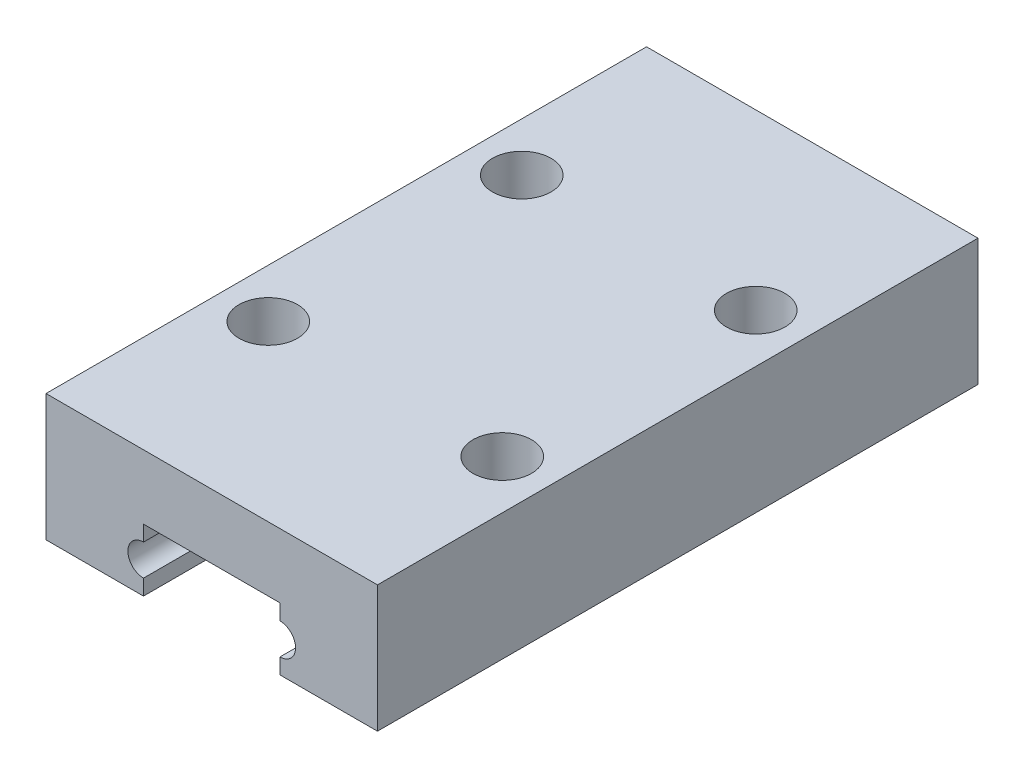
ISO-10303-21;
HEADER;
FILE_DESCRIPTION(('STEP AP214'),'2;1');
FILE_NAME('part.step','',(''),(''),'','','');
FILE_SCHEMA(('AUTOMOTIVE_DESIGN { 1 0 10303 214 1 1 1 1 }'));
ENDSEC;
DATA;
#1=APPLICATION_CONTEXT('core data for automotive mechanical design processes');
#2=APPLICATION_PROTOCOL_DEFINITION('international standard','automotive_design',2000,#1);
#3=PRODUCT_CONTEXT('',#1,'mechanical');
#4=PRODUCT('Part','Part','',(#3));
#5=PRODUCT_RELATED_PRODUCT_CATEGORY('part','',(#4));
#6=PRODUCT_DEFINITION_FORMATION('','',#4);
#7=PRODUCT_DEFINITION_CONTEXT('part definition',#1,'design');
#8=PRODUCT_DEFINITION('design','',#6,#7);
#9=PRODUCT_DEFINITION_SHAPE('','',#8);
#10=(LENGTH_UNIT() NAMED_UNIT(*) SI_UNIT(.MILLI.,.METRE.));
#11=(NAMED_UNIT(*) PLANE_ANGLE_UNIT() SI_UNIT($,.RADIAN.));
#12=(NAMED_UNIT(*) SI_UNIT($,.STERADIAN.) SOLID_ANGLE_UNIT());
#13=UNCERTAINTY_MEASURE_WITH_UNIT(LENGTH_MEASURE(1.E-05),#10,'distance_accuracy_value','');
#14=(GEOMETRIC_REPRESENTATION_CONTEXT(3) GLOBAL_UNCERTAINTY_ASSIGNED_CONTEXT((#13)) GLOBAL_UNIT_ASSIGNED_CONTEXT((#10,
#11,#12)) REPRESENTATION_CONTEXT('',''));
#15=CARTESIAN_POINT('',(0.,0.,0.));
#16=DIRECTION('',(0.,0.,1.));
#17=DIRECTION('',(1.,0.,0.));
#18=AXIS2_PLACEMENT_3D('',#15,#16,#17);
#19=CARTESIAN_POINT('',(-8.5,6.5,30.8));
#20=DIRECTION('',(1.,0.,0.));
#21=DIRECTION('',(0.,1.,0.));
#22=AXIS2_PLACEMENT_3D('',#19,#20,#21);
#23=PLANE('',#22);
#24=DIRECTION('',(0.,-1.,0.));
#25=VECTOR('',#24,1.);
#26=CARTESIAN_POINT('',(-8.5,6.5,0.));
#27=LINE('',#26,#25);
#28=CARTESIAN_POINT('',(-8.5,6.5,0.));
#29=VERTEX_POINT('',#28);
#30=CARTESIAN_POINT('',(-8.5,0.,0.));
#31=VERTEX_POINT('',#30);
#32=EDGE_CURVE('E155',#29,#31,#27,.T.);
#33=ORIENTED_EDGE('',*,*,#32,.T.);
#34=DIRECTION('',(0.,0.,-1.));
#35=VECTOR('',#34,1.);
#36=CARTESIAN_POINT('',(-8.5,0.,30.8));
#37=LINE('',#36,#35);
#38=CARTESIAN_POINT('',(-8.5,0.,30.8));
#39=VERTEX_POINT('',#38);
#40=EDGE_CURVE('E11',#39,#31,#37,.T.);
#41=ORIENTED_EDGE('',*,*,#40,.F.);
#42=DIRECTION('',(0.,-1.,0.));
#43=VECTOR('',#42,1.);
#44=CARTESIAN_POINT('',(-8.5,6.5,30.8));
#45=LINE('',#44,#43);
#46=CARTESIAN_POINT('',(-8.5,6.5,30.8));
#47=VERTEX_POINT('',#46);
#48=EDGE_CURVE('E186',#47,#39,#45,.T.);
#49=ORIENTED_EDGE('',*,*,#48,.F.);
#50=DIRECTION('',(0.,0.,-1.));
#51=VECTOR('',#50,1.);
#52=CARTESIAN_POINT('',(-8.5,6.5,30.8));
#53=LINE('',#52,#51);
#54=EDGE_CURVE('E50',#47,#29,#53,.T.);
#55=ORIENTED_EDGE('',*,*,#54,.T.);
#56=EDGE_LOOP('',(#33,#41,#49,#55));
#57=FACE_BOUND('',#56,.T.);
#58=ADVANCED_FACE('F34',(#57),#23,.F.);
#59=CARTESIAN_POINT('',(-8.5,0.,30.8));
#60=DIRECTION('',(0.,1.,0.));
#61=DIRECTION('',(-1.,0.,0.));
#62=AXIS2_PLACEMENT_3D('',#59,#60,#61);
#63=PLANE('',#62);
#64=CARTESIAN_POINT('',(-5.99999999999999,0.,21.9));
#65=DIRECTION('',(0.,1.,0.));
#66=DIRECTION('',(-1.,0.,0.));
#67=AXIS2_PLACEMENT_3D('',#64,#65,#66);
#68=CIRCLE('',#67,1.5);
#69=CARTESIAN_POINT('',(-7.49999999999999,0.,21.9));
#70=VERTEX_POINT('',#69);
#71=EDGE_CURVE('E262',#70,#70,#68,.T.);
#72=ORIENTED_EDGE('',*,*,#71,.T.);
#73=EDGE_LOOP('',(#72));
#74=FACE_BOUND('',#73,.T.);
#75=CARTESIAN_POINT('',(-6.,0.,8.90000000000001));
#76=DIRECTION('',(0.,1.,0.));
#77=DIRECTION('',(-1.,0.,0.));
#78=AXIS2_PLACEMENT_3D('',#75,#76,#77);
#79=CIRCLE('',#78,1.5);
#80=CARTESIAN_POINT('',(-7.5,0.,8.90000000000001));
#81=VERTEX_POINT('',#80);
#82=EDGE_CURVE('E265',#81,#81,#79,.T.);
#83=ORIENTED_EDGE('',*,*,#82,.T.);
#84=EDGE_LOOP('',(#83));
#85=FACE_BOUND('',#84,.T.);
#86=DIRECTION('',(1.,0.,0.));
#87=VECTOR('',#86,1.);
#88=CARTESIAN_POINT('',(-8.5,0.,0.));
#89=LINE('',#88,#87);
#90=CARTESIAN_POINT('',(-3.5,0.,0.));
#91=VERTEX_POINT('',#90);
#92=EDGE_CURVE('E157',#31,#91,#89,.T.);
#93=ORIENTED_EDGE('',*,*,#92,.T.);
#94=DIRECTION('',(0.,0.,-1.));
#95=VECTOR('',#94,1.);
#96=CARTESIAN_POINT('',(-3.5,0.,30.8));
#97=LINE('',#96,#95);
#98=CARTESIAN_POINT('',(-3.5,0.,30.8));
#99=VERTEX_POINT('',#98);
#100=EDGE_CURVE('E42',#99,#91,#97,.T.);
#101=ORIENTED_EDGE('',*,*,#100,.F.);
#102=DIRECTION('',(1.,0.,0.));
#103=VECTOR('',#102,1.);
#104=CARTESIAN_POINT('',(-8.5,0.,30.8));
#105=LINE('',#104,#103);
#106=EDGE_CURVE('E100',#39,#99,#105,.T.);
#107=ORIENTED_EDGE('',*,*,#106,.F.);
#108=ORIENTED_EDGE('',*,*,#40,.T.);
#109=EDGE_LOOP('',(#93,#101,#107,#108));
#110=FACE_BOUND('',#109,.T.);
#111=ADVANCED_FACE('F252',(#74,#85,#110),#63,.F.);
#112=CARTESIAN_POINT('',(-3.5,0.,30.8));
#113=DIRECTION('',(-1.,0.,0.));
#114=DIRECTION('',(0.,0.,1.));
#115=AXIS2_PLACEMENT_3D('',#112,#113,#114);
#116=PLANE('',#115);
#117=DIRECTION('',(0.,1.,0.));
#118=VECTOR('',#117,1.);
#119=CARTESIAN_POINT('',(-3.5,0.,0.));
#120=LINE('',#119,#118);
#121=CARTESIAN_POINT('',(-3.5,0.8,0.));
#122=VERTEX_POINT('',#121);
#123=EDGE_CURVE('E160',#91,#122,#120,.T.);
#124=ORIENTED_EDGE('',*,*,#123,.T.);
#125=DIRECTION('',(0.,0.,-1.));
#126=VECTOR('',#125,1.);
#127=CARTESIAN_POINT('',(-3.5,0.8,30.8));
#128=LINE('',#127,#126);
#129=CARTESIAN_POINT('',(-3.5,0.8,30.8));
#130=VERTEX_POINT('',#129);
#131=EDGE_CURVE('E200',#130,#122,#128,.T.);
#132=ORIENTED_EDGE('',*,*,#131,.F.);
#133=DIRECTION('',(0.,1.,0.));
#134=VECTOR('',#133,1.);
#135=CARTESIAN_POINT('',(-3.5,0.,30.8));
#136=LINE('',#135,#134);
#137=EDGE_CURVE('E208',#99,#130,#136,.T.);
#138=ORIENTED_EDGE('',*,*,#137,.F.);
#139=ORIENTED_EDGE('',*,*,#100,.T.);
#140=EDGE_LOOP('',(#124,#132,#138,#139));
#141=FACE_BOUND('',#140,.T.);
#142=ADVANCED_FACE('F206',(#141),#116,.F.);
#143=CARTESIAN_POINT('',(-3.5,1.6,30.8));
#144=DIRECTION('',(0.,0.,-1.));
#145=DIRECTION('',(-1.,0.,0.));
#146=AXIS2_PLACEMENT_3D('',#143,#144,#145);
#147=CYLINDRICAL_SURFACE('',#146,0.8);
#148=CARTESIAN_POINT('',(-3.5,1.6,0.));
#149=DIRECTION('',(0.,0.,-1.));
#150=DIRECTION('',(-1.,0.,0.));
#151=AXIS2_PLACEMENT_3D('',#148,#149,#150);
#152=CIRCLE('',#151,0.8);
#153=CARTESIAN_POINT('',(-3.5,2.4,0.));
#154=VERTEX_POINT('',#153);
#155=EDGE_CURVE('E162',#122,#154,#152,.T.);
#156=ORIENTED_EDGE('',*,*,#155,.T.);
#157=DIRECTION('',(0.,0.,-1.));
#158=VECTOR('',#157,1.);
#159=CARTESIAN_POINT('',(-3.5,2.4,30.8));
#160=LINE('',#159,#158);
#161=CARTESIAN_POINT('',(-3.5,2.4,30.8));
#162=VERTEX_POINT('',#161);
#163=EDGE_CURVE('E198',#162,#154,#160,.T.);
#164=ORIENTED_EDGE('',*,*,#163,.F.);
#165=CARTESIAN_POINT('',(-3.5,1.6,30.8));
#166=DIRECTION('',(0.,0.,-1.));
#167=DIRECTION('',(-1.,0.,0.));
#168=AXIS2_PLACEMENT_3D('',#165,#166,#167);
#169=CIRCLE('',#168,0.8);
#170=EDGE_CURVE('E218',#130,#162,#169,.T.);
#171=ORIENTED_EDGE('',*,*,#170,.F.);
#172=ORIENTED_EDGE('',*,*,#131,.T.);
#173=EDGE_LOOP('',(#156,#164,#171,#172));
#174=FACE_BOUND('',#173,.T.);
#175=ADVANCED_FACE('F215',(#174),#147,.F.);
#176=CARTESIAN_POINT('',(-3.5,3.2,30.8));
#177=DIRECTION('',(1.,0.,0.));
#178=DIRECTION('',(0.,1.,0.));
#179=AXIS2_PLACEMENT_3D('',#176,#177,#178);
#180=PLANE('',#179);
#181=DIRECTION('',(0.,-1.,0.));
#182=VECTOR('',#181,1.);
#183=CARTESIAN_POINT('',(-3.5,3.2,0.));
#184=LINE('',#183,#182);
#185=CARTESIAN_POINT('',(-3.5,3.2,0.));
#186=VERTEX_POINT('',#185);
#187=EDGE_CURVE('E165',#186,#154,#184,.T.);
#188=ORIENTED_EDGE('',*,*,#187,.F.);
#189=DIRECTION('',(0.,0.,-1.));
#190=VECTOR('',#189,1.);
#191=CARTESIAN_POINT('',(-3.5,3.2,30.8));
#192=LINE('',#191,#190);
#193=CARTESIAN_POINT('',(-3.5,3.2,30.8));
#194=VERTEX_POINT('',#193);
#195=EDGE_CURVE('E196',#194,#186,#192,.T.);
#196=ORIENTED_EDGE('',*,*,#195,.F.);
#197=DIRECTION('',(0.,-1.,0.));
#198=VECTOR('',#197,1.);
#199=CARTESIAN_POINT('',(-3.5,3.2,30.8));
#200=LINE('',#199,#198);
#201=EDGE_CURVE('E220',#194,#162,#200,.T.);
#202=ORIENTED_EDGE('',*,*,#201,.T.);
#203=ORIENTED_EDGE('',*,*,#163,.T.);
#204=EDGE_LOOP('',(#188,#196,#202,#203));
#205=FACE_BOUND('',#204,.T.);
#206=ADVANCED_FACE('F332',(#205),#180,.T.);
#207=CARTESIAN_POINT('',(3.5,3.2,30.8));
#208=DIRECTION('',(0.,-1.,0.));
#209=DIRECTION('',(0.,0.,-1.));
#210=AXIS2_PLACEMENT_3D('',#207,#208,#209);
#211=PLANE('',#210);
#212=DIRECTION('',(-1.,0.,0.));
#213=VECTOR('',#212,1.);
#214=CARTESIAN_POINT('',(3.5,3.2,0.));
#215=LINE('',#214,#213);
#216=CARTESIAN_POINT('',(3.5,3.2,0.));
#217=VERTEX_POINT('',#216);
#218=EDGE_CURVE('E168',#217,#186,#215,.T.);
#219=ORIENTED_EDGE('',*,*,#218,.F.);
#220=DIRECTION('',(0.,0.,-1.));
#221=VECTOR('',#220,1.);
#222=CARTESIAN_POINT('',(3.5,3.2,30.8));
#223=LINE('',#222,#221);
#224=CARTESIAN_POINT('',(3.5,3.2,30.8));
#225=VERTEX_POINT('',#224);
#226=EDGE_CURVE('E194',#225,#217,#223,.T.);
#227=ORIENTED_EDGE('',*,*,#226,.F.);
#228=DIRECTION('',(-1.,0.,0.));
#229=VECTOR('',#228,1.);
#230=CARTESIAN_POINT('',(3.5,3.2,30.8));
#231=LINE('',#230,#229);
#232=EDGE_CURVE('E222',#225,#194,#231,.T.);
#233=ORIENTED_EDGE('',*,*,#232,.T.);
#234=ORIENTED_EDGE('',*,*,#195,.T.);
#235=EDGE_LOOP('',(#219,#227,#233,#234));
#236=FACE_BOUND('',#235,.T.);
#237=ADVANCED_FACE('F328',(#236),#211,.T.);
#238=CARTESIAN_POINT('',(3.5,2.4,30.8));
#239=DIRECTION('',(-1.,0.,0.));
#240=DIRECTION('',(0.,-1.,0.));
#241=AXIS2_PLACEMENT_3D('',#238,#239,#240);
#242=PLANE('',#241);
#243=DIRECTION('',(0.,1.,0.));
#244=VECTOR('',#243,1.);
#245=CARTESIAN_POINT('',(3.5,2.4,0.));
#246=LINE('',#245,#244);
#247=CARTESIAN_POINT('',(3.5,2.4,0.));
#248=VERTEX_POINT('',#247);
#249=EDGE_CURVE('E171',#248,#217,#246,.T.);
#250=ORIENTED_EDGE('',*,*,#249,.F.);
#251=DIRECTION('',(0.,0.,-1.));
#252=VECTOR('',#251,1.);
#253=CARTESIAN_POINT('',(3.5,2.4,30.8));
#254=LINE('',#253,#252);
#255=CARTESIAN_POINT('',(3.5,2.4,30.8));
#256=VERTEX_POINT('',#255);
#257=EDGE_CURVE('E192',#256,#248,#254,.T.);
#258=ORIENTED_EDGE('',*,*,#257,.F.);
#259=DIRECTION('',(0.,1.,0.));
#260=VECTOR('',#259,1.);
#261=CARTESIAN_POINT('',(3.5,2.4,30.8));
#262=LINE('',#261,#260);
#263=EDGE_CURVE('E229',#256,#225,#262,.T.);
#264=ORIENTED_EDGE('',*,*,#263,.T.);
#265=ORIENTED_EDGE('',*,*,#226,.T.);
#266=EDGE_LOOP('',(#250,#258,#264,#265));
#267=FACE_BOUND('',#266,.T.);
#268=ADVANCED_FACE('F324',(#267),#242,.T.);
#269=CARTESIAN_POINT('',(3.5,1.6,30.8));
#270=DIRECTION('',(0.,0.,-1.));
#271=DIRECTION('',(-1.,0.,0.));
#272=AXIS2_PLACEMENT_3D('',#269,#270,#271);
#273=CYLINDRICAL_SURFACE('',#272,0.8);
#274=CARTESIAN_POINT('',(3.5,1.6,0.));
#275=DIRECTION('',(0.,0.,1.));
#276=DIRECTION('',(1.,0.,0.));
#277=AXIS2_PLACEMENT_3D('',#274,#275,#276);
#278=CIRCLE('',#277,0.8);
#279=CARTESIAN_POINT('',(3.5,0.8,0.));
#280=VERTEX_POINT('',#279);
#281=EDGE_CURVE('E174',#280,#248,#278,.T.);
#282=ORIENTED_EDGE('',*,*,#281,.F.);
#283=DIRECTION('',(0.,0.,-1.));
#284=VECTOR('',#283,1.);
#285=CARTESIAN_POINT('',(3.5,0.8,30.8));
#286=LINE('',#285,#284);
#287=CARTESIAN_POINT('',(3.5,0.8,30.8));
#288=VERTEX_POINT('',#287);
#289=EDGE_CURVE('E190',#288,#280,#286,.T.);
#290=ORIENTED_EDGE('',*,*,#289,.F.);
#291=CARTESIAN_POINT('',(3.5,1.6,30.8));
#292=DIRECTION('',(0.,0.,1.));
#293=DIRECTION('',(1.,0.,0.));
#294=AXIS2_PLACEMENT_3D('',#291,#292,#293);
#295=CIRCLE('',#294,0.8);
#296=EDGE_CURVE('E232',#288,#256,#295,.T.);
#297=ORIENTED_EDGE('',*,*,#296,.T.);
#298=ORIENTED_EDGE('',*,*,#257,.T.);
#299=EDGE_LOOP('',(#282,#290,#297,#298));
#300=FACE_BOUND('',#299,.T.);
#301=ADVANCED_FACE('F319',(#300),#273,.F.);
#302=CARTESIAN_POINT('',(3.5,0.,30.8));
#303=DIRECTION('',(-1.,0.,0.));
#304=DIRECTION('',(0.,0.,1.));
#305=AXIS2_PLACEMENT_3D('',#302,#303,#304);
#306=PLANE('',#305);
#307=DIRECTION('',(0.,1.,0.));
#308=VECTOR('',#307,1.);
#309=CARTESIAN_POINT('',(3.5,0.,0.));
#310=LINE('',#309,#308);
#311=CARTESIAN_POINT('',(3.5,0.,0.));
#312=VERTEX_POINT('',#311);
#313=EDGE_CURVE('E177',#312,#280,#310,.T.);
#314=ORIENTED_EDGE('',*,*,#313,.F.);
#315=DIRECTION('',(0.,0.,-1.));
#316=VECTOR('',#315,1.);
#317=CARTESIAN_POINT('',(3.5,0.,30.8));
#318=LINE('',#317,#316);
#319=CARTESIAN_POINT('',(3.5,0.,30.8));
#320=VERTEX_POINT('',#319);
#321=EDGE_CURVE('E137',#320,#312,#318,.T.);
#322=ORIENTED_EDGE('',*,*,#321,.F.);
#323=DIRECTION('',(0.,1.,0.));
#324=VECTOR('',#323,1.);
#325=CARTESIAN_POINT('',(3.5,0.,30.8));
#326=LINE('',#325,#324);
#327=EDGE_CURVE('E147',#320,#288,#326,.T.);
#328=ORIENTED_EDGE('',*,*,#327,.T.);
#329=ORIENTED_EDGE('',*,*,#289,.T.);
#330=EDGE_LOOP('',(#314,#322,#328,#329));
#331=FACE_BOUND('',#330,.T.);
#332=ADVANCED_FACE('F236',(#331),#306,.T.);
#333=CARTESIAN_POINT('',(8.5,0.,30.8));
#334=DIRECTION('',(0.,-1.,0.));
#335=DIRECTION('',(1.,0.,0.));
#336=AXIS2_PLACEMENT_3D('',#333,#334,#335);
#337=PLANE('',#336);
#338=CARTESIAN_POINT('',(6.,0.,8.9));
#339=DIRECTION('',(0.,-1.,0.));
#340=DIRECTION('',(1.,0.,0.));
#341=AXIS2_PLACEMENT_3D('',#338,#339,#340);
#342=CIRCLE('',#341,1.5);
#343=CARTESIAN_POINT('',(7.5,0.,8.9));
#344=VERTEX_POINT('',#343);
#345=EDGE_CURVE('E158',#344,#344,#342,.T.);
#346=ORIENTED_EDGE('',*,*,#345,.F.);
#347=EDGE_LOOP('',(#346));
#348=FACE_BOUND('',#347,.T.);
#349=CARTESIAN_POINT('',(6.,0.,21.9));
#350=DIRECTION('',(0.,-1.,0.));
#351=DIRECTION('',(1.,0.,0.));
#352=AXIS2_PLACEMENT_3D('',#349,#350,#351);
#353=CIRCLE('',#352,1.5);
#354=CARTESIAN_POINT('',(7.5,0.,21.9));
#355=VERTEX_POINT('',#354);
#356=EDGE_CURVE('E268',#355,#355,#353,.T.);
#357=ORIENTED_EDGE('',*,*,#356,.F.);
#358=EDGE_LOOP('',(#357));
#359=FACE_BOUND('',#358,.T.);
#360=DIRECTION('',(-1.,0.,0.));
#361=VECTOR('',#360,1.);
#362=CARTESIAN_POINT('',(8.5,0.,0.));
#363=LINE('',#362,#361);
#364=CARTESIAN_POINT('',(8.5,0.,0.));
#365=VERTEX_POINT('',#364);
#366=EDGE_CURVE('E133',#365,#312,#363,.T.);
#367=ORIENTED_EDGE('',*,*,#366,.F.);
#368=DIRECTION('',(0.,0.,-1.));
#369=VECTOR('',#368,1.);
#370=CARTESIAN_POINT('',(8.5,0.,30.8));
#371=LINE('',#370,#369);
#372=CARTESIAN_POINT('',(8.5,0.,30.8));
#373=VERTEX_POINT('',#372);
#374=EDGE_CURVE('E128',#373,#365,#371,.T.);
#375=ORIENTED_EDGE('',*,*,#374,.F.);
#376=DIRECTION('',(-1.,0.,0.));
#377=VECTOR('',#376,1.);
#378=CARTESIAN_POINT('',(8.5,0.,30.8));
#379=LINE('',#378,#377);
#380=EDGE_CURVE('E131',#373,#320,#379,.T.);
#381=ORIENTED_EDGE('',*,*,#380,.T.);
#382=ORIENTED_EDGE('',*,*,#321,.T.);
#383=EDGE_LOOP('',(#367,#375,#381,#382));
#384=FACE_BOUND('',#383,.T.);
#385=ADVANCED_FACE('F130',(#348,#359,#384),#337,.T.);
#386=CARTESIAN_POINT('',(8.5,6.5,30.8));
#387=DIRECTION('',(1.,0.,0.));
#388=DIRECTION('',(0.,1.,0.));
#389=AXIS2_PLACEMENT_3D('',#386,#387,#388);
#390=PLANE('',#389);
#391=DIRECTION('',(0.,-1.,0.));
#392=VECTOR('',#391,1.);
#393=CARTESIAN_POINT('',(8.5,6.5,0.));
#394=LINE('',#393,#392);
#395=CARTESIAN_POINT('',(8.5,6.5,0.));
#396=VERTEX_POINT('',#395);
#397=EDGE_CURVE('E181',#396,#365,#394,.T.);
#398=ORIENTED_EDGE('',*,*,#397,.F.);
#399=DIRECTION('',(0.,0.,-1.));
#400=VECTOR('',#399,1.);
#401=CARTESIAN_POINT('',(8.5,6.5,30.8));
#402=LINE('',#401,#400);
#403=CARTESIAN_POINT('',(8.5,6.5,30.8));
#404=VERTEX_POINT('',#403);
#405=EDGE_CURVE('E88',#404,#396,#402,.T.);
#406=ORIENTED_EDGE('',*,*,#405,.F.);
#407=DIRECTION('',(0.,-1.,0.));
#408=VECTOR('',#407,1.);
#409=CARTESIAN_POINT('',(8.5,6.5,30.8));
#410=LINE('',#409,#408);
#411=EDGE_CURVE('E144',#404,#373,#410,.T.);
#412=ORIENTED_EDGE('',*,*,#411,.T.);
#413=ORIENTED_EDGE('',*,*,#374,.T.);
#414=EDGE_LOOP('',(#398,#406,#412,#413));
#415=FACE_BOUND('',#414,.T.);
#416=ADVANCED_FACE('F149',(#415),#390,.T.);
#417=CARTESIAN_POINT('',(-8.5,6.5,30.8));
#418=DIRECTION('',(0.,1.,0.));
#419=DIRECTION('',(0.,0.,1.));
#420=AXIS2_PLACEMENT_3D('',#417,#418,#419);
#421=PLANE('',#420);
#422=CARTESIAN_POINT('',(6.,6.5,8.9));
#423=DIRECTION('',(0.,1.,0.));
#424=DIRECTION('',(0.,0.,1.));
#425=AXIS2_PLACEMENT_3D('',#422,#423,#424);
#426=CIRCLE('',#425,1.5);
#427=CARTESIAN_POINT('',(6.,6.5,10.4));
#428=VERTEX_POINT('',#427);
#429=EDGE_CURVE('E274',#428,#428,#426,.T.);
#430=ORIENTED_EDGE('',*,*,#429,.F.);
#431=EDGE_LOOP('',(#430));
#432=FACE_BOUND('',#431,.T.);
#433=CARTESIAN_POINT('',(-5.99999999999999,6.5,21.9));
#434=DIRECTION('',(0.,1.,0.));
#435=DIRECTION('',(0.,0.,-1.));
#436=AXIS2_PLACEMENT_3D('',#433,#434,#435);
#437=CIRCLE('',#436,1.5);
#438=CARTESIAN_POINT('',(-5.99999999999999,6.5,20.4));
#439=VERTEX_POINT('',#438);
#440=EDGE_CURVE('E275',#439,#439,#437,.T.);
#441=ORIENTED_EDGE('',*,*,#440,.F.);
#442=EDGE_LOOP('',(#441));
#443=FACE_BOUND('',#442,.T.);
#444=CARTESIAN_POINT('',(-6.,6.5,8.90000000000001));
#445=DIRECTION('',(0.,1.,0.));
#446=DIRECTION('',(0.,0.,-1.));
#447=AXIS2_PLACEMENT_3D('',#444,#445,#446);
#448=CIRCLE('',#447,1.5);
#449=CARTESIAN_POINT('',(-6.,6.5,7.4));
#450=VERTEX_POINT('',#449);
#451=EDGE_CURVE('E278',#450,#450,#448,.T.);
#452=ORIENTED_EDGE('',*,*,#451,.F.);
#453=EDGE_LOOP('',(#452));
#454=FACE_BOUND('',#453,.T.);
#455=CARTESIAN_POINT('',(6.,6.5,21.9));
#456=DIRECTION('',(0.,1.,0.));
#457=DIRECTION('',(0.,0.,1.));
#458=AXIS2_PLACEMENT_3D('',#455,#456,#457);
#459=CIRCLE('',#458,1.5);
#460=CARTESIAN_POINT('',(6.,6.5,23.4));
#461=VERTEX_POINT('',#460);
#462=EDGE_CURVE('E271',#461,#461,#459,.T.);
#463=ORIENTED_EDGE('',*,*,#462,.F.);
#464=EDGE_LOOP('',(#463));
#465=FACE_BOUND('',#464,.T.);
#466=DIRECTION('',(1.,0.,0.));
#467=VECTOR('',#466,1.);
#468=CARTESIAN_POINT('',(-8.5,6.5,0.));
#469=LINE('',#468,#467);
#470=EDGE_CURVE('E183',#29,#396,#469,.T.);
#471=ORIENTED_EDGE('',*,*,#470,.F.);
#472=ORIENTED_EDGE('',*,*,#54,.F.);
#473=DIRECTION('',(1.,0.,0.));
#474=VECTOR('',#473,1.);
#475=CARTESIAN_POINT('',(-8.5,6.5,30.8));
#476=LINE('',#475,#474);
#477=EDGE_CURVE('E150',#47,#404,#476,.T.);
#478=ORIENTED_EDGE('',*,*,#477,.T.);
#479=ORIENTED_EDGE('',*,*,#405,.T.);
#480=EDGE_LOOP('',(#471,#472,#478,#479));
#481=FACE_BOUND('',#480,.T.);
#482=ADVANCED_FACE('F238',(#432,#443,#454,#465,#481),#421,.T.);
#483=CARTESIAN_POINT('',(-3.5,1.6,30.8));
#484=DIRECTION('',(0.,0.,-1.));
#485=DIRECTION('',(-1.,0.,0.));
#486=AXIS2_PLACEMENT_3D('',#483,#484,#485);
#487=PLANE('',#486);
#488=ORIENTED_EDGE('',*,*,#48,.T.);
#489=ORIENTED_EDGE('',*,*,#106,.T.);
#490=ORIENTED_EDGE('',*,*,#137,.T.);
#491=ORIENTED_EDGE('',*,*,#170,.T.);
#492=ORIENTED_EDGE('',*,*,#201,.F.);
#493=ORIENTED_EDGE('',*,*,#232,.F.);
#494=ORIENTED_EDGE('',*,*,#263,.F.);
#495=ORIENTED_EDGE('',*,*,#296,.F.);
#496=ORIENTED_EDGE('',*,*,#327,.F.);
#497=ORIENTED_EDGE('',*,*,#380,.F.);
#498=ORIENTED_EDGE('',*,*,#411,.F.);
#499=ORIENTED_EDGE('',*,*,#477,.F.);
#500=EDGE_LOOP('',(#488,#489,#490,#491,#492,#493,#494,#495,#496,#497,#498,#499));
#501=FACE_BOUND('',#500,.T.);
#502=ADVANCED_FACE('F142',(#501),#487,.F.);
#503=CARTESIAN_POINT('',(-3.5,1.6,0.));
#504=DIRECTION('',(0.,0.,-1.));
#505=DIRECTION('',(-1.,0.,0.));
#506=AXIS2_PLACEMENT_3D('',#503,#504,#505);
#507=PLANE('',#506);
#508=ORIENTED_EDGE('',*,*,#32,.F.);
#509=ORIENTED_EDGE('',*,*,#470,.T.);
#510=ORIENTED_EDGE('',*,*,#397,.T.);
#511=ORIENTED_EDGE('',*,*,#366,.T.);
#512=ORIENTED_EDGE('',*,*,#313,.T.);
#513=ORIENTED_EDGE('',*,*,#281,.T.);
#514=ORIENTED_EDGE('',*,*,#249,.T.);
#515=ORIENTED_EDGE('',*,*,#218,.T.);
#516=ORIENTED_EDGE('',*,*,#187,.T.);
#517=ORIENTED_EDGE('',*,*,#155,.F.);
#518=ORIENTED_EDGE('',*,*,#123,.F.);
#519=ORIENTED_EDGE('',*,*,#92,.F.);
#520=EDGE_LOOP('',(#508,#509,#510,#511,#512,#513,#514,#515,#516,#517,#518,#519));
#521=FACE_BOUND('',#520,.T.);
#522=ADVANCED_FACE('F211',(#521),#507,.T.);
#523=CARTESIAN_POINT('',(6.,-24.3,21.9));
#524=DIRECTION('',(0.,1.,0.));
#525=DIRECTION('',(0.,0.,1.));
#526=AXIS2_PLACEMENT_3D('',#523,#524,#525);
#527=CYLINDRICAL_SURFACE('',#526,1.5);
#528=ORIENTED_EDGE('',*,*,#356,.T.);
#529=EDGE_LOOP('',(#528));
#530=FACE_BOUND('',#529,.T.);
#531=ORIENTED_EDGE('',*,*,#462,.T.);
#532=EDGE_LOOP('',(#531));
#533=FACE_BOUND('',#532,.T.);
#534=ADVANCED_FACE('F290',(#530,#533),#527,.F.);
#535=CARTESIAN_POINT('',(-6.,-24.3,8.90000000000001));
#536=DIRECTION('',(0.,1.,0.));
#537=DIRECTION('',(0.,0.,1.));
#538=AXIS2_PLACEMENT_3D('',#535,#536,#537);
#539=CYLINDRICAL_SURFACE('',#538,1.5);
#540=ORIENTED_EDGE('',*,*,#451,.T.);
#541=EDGE_LOOP('',(#540));
#542=FACE_BOUND('',#541,.T.);
#543=ORIENTED_EDGE('',*,*,#82,.F.);
#544=EDGE_LOOP('',(#543));
#545=FACE_BOUND('',#544,.T.);
#546=ADVANCED_FACE('F284',(#542,#545),#539,.F.);
#547=CARTESIAN_POINT('',(-5.99999999999999,-24.3,21.9));
#548=DIRECTION('',(0.,1.,0.));
#549=DIRECTION('',(0.,0.,1.));
#550=AXIS2_PLACEMENT_3D('',#547,#548,#549);
#551=CYLINDRICAL_SURFACE('',#550,1.5);
#552=ORIENTED_EDGE('',*,*,#440,.T.);
#553=EDGE_LOOP('',(#552));
#554=FACE_BOUND('',#553,.T.);
#555=ORIENTED_EDGE('',*,*,#71,.F.);
#556=EDGE_LOOP('',(#555));
#557=FACE_BOUND('',#556,.T.);
#558=ADVANCED_FACE('F298',(#554,#557),#551,.F.);
#559=CARTESIAN_POINT('',(6.,-24.3,8.9));
#560=DIRECTION('',(0.,1.,0.));
#561=DIRECTION('',(0.,0.,1.));
#562=AXIS2_PLACEMENT_3D('',#559,#560,#561);
#563=CYLINDRICAL_SURFACE('',#562,1.5);
#564=ORIENTED_EDGE('',*,*,#345,.T.);
#565=EDGE_LOOP('',(#564));
#566=FACE_BOUND('',#565,.T.);
#567=ORIENTED_EDGE('',*,*,#429,.T.);
#568=EDGE_LOOP('',(#567));
#569=FACE_BOUND('',#568,.T.);
#570=ADVANCED_FACE('F303',(#566,#569),#563,.F.);
#571=CLOSED_SHELL('',(#58,#111,#142,#175,#206,#237,#268,#301,#332,#385,#416,#482,#502,#522,#534,
#546,#558,#570));
#572=MANIFOLD_SOLID_BREP('B2',#571);
#573=ADVANCED_BREP_SHAPE_REPRESENTATION('',(#18,#572),#14);
#574=SHAPE_DEFINITION_REPRESENTATION(#9,#573);
ENDSEC;
END-ISO-10303-21;
